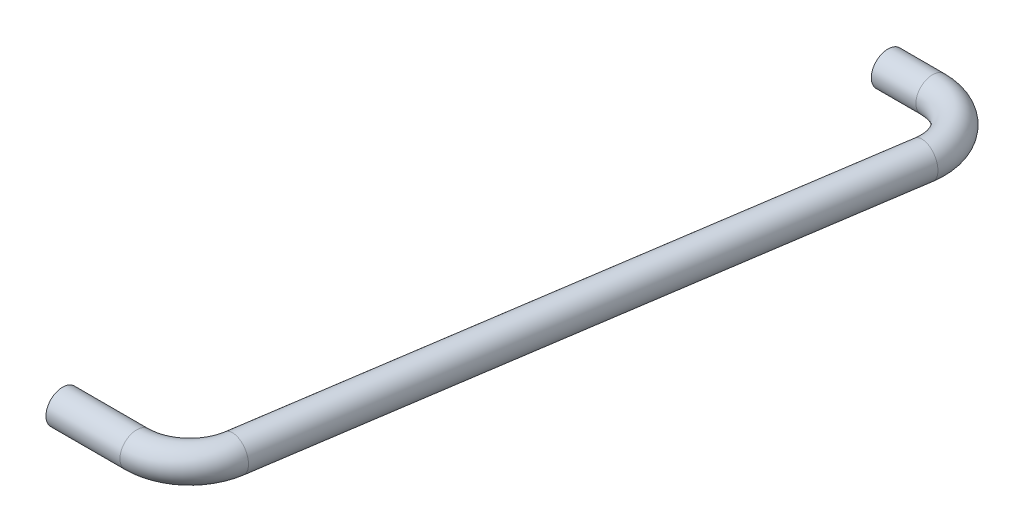
ISO-10303-21;
HEADER;
FILE_DESCRIPTION(('STEP AP214'),'2;1');
FILE_NAME('part.step','',(''),(''),'','','');
FILE_SCHEMA(('AUTOMOTIVE_DESIGN { 1 0 10303 214 1 1 1 1 }'));
ENDSEC;
DATA;
#1=APPLICATION_CONTEXT('core data for automotive mechanical design processes');
#2=APPLICATION_PROTOCOL_DEFINITION('international standard','automotive_design',2000,#1);
#3=PRODUCT_CONTEXT('',#1,'mechanical');
#4=PRODUCT('Part','Part','',(#3));
#5=PRODUCT_RELATED_PRODUCT_CATEGORY('part','',(#4));
#6=PRODUCT_DEFINITION_FORMATION('','',#4);
#7=PRODUCT_DEFINITION_CONTEXT('part definition',#1,'design');
#8=PRODUCT_DEFINITION('design','',#6,#7);
#9=PRODUCT_DEFINITION_SHAPE('','',#8);
#10=(LENGTH_UNIT() NAMED_UNIT(*) SI_UNIT(.MILLI.,.METRE.));
#11=(NAMED_UNIT(*) PLANE_ANGLE_UNIT() SI_UNIT($,.RADIAN.));
#12=(NAMED_UNIT(*) SI_UNIT($,.STERADIAN.) SOLID_ANGLE_UNIT());
#13=UNCERTAINTY_MEASURE_WITH_UNIT(LENGTH_MEASURE(1.E-05),#10,'distance_accuracy_value','');
#14=(GEOMETRIC_REPRESENTATION_CONTEXT(3) GLOBAL_UNCERTAINTY_ASSIGNED_CONTEXT((#13)) GLOBAL_UNIT_ASSIGNED_CONTEXT((#10,
#11,#12)) REPRESENTATION_CONTEXT('',''));
#15=CARTESIAN_POINT('',(0.,0.,0.));
#16=DIRECTION('',(0.,0.,1.));
#17=DIRECTION('',(1.,0.,0.));
#18=AXIS2_PLACEMENT_3D('',#15,#16,#17);
#19=CARTESIAN_POINT('',(-17.,0.,53.));
#20=DIRECTION('',(1.,0.,0.));
#21=DIRECTION('',(0.,0.,-1.));
#22=AXIS2_PLACEMENT_3D('',#19,#20,#21);
#23=PLANE('',#22);
#24=CARTESIAN_POINT('',(-17.,0.,53.));
#25=DIRECTION('',(1.,0.,0.));
#26=DIRECTION('',(0.,0.,-1.));
#27=AXIS2_PLACEMENT_3D('',#24,#25,#26);
#28=CIRCLE('',#27,1.25);
#29=CARTESIAN_POINT('',(-17.,0.,51.75));
#30=VERTEX_POINT('',#29);
#31=EDGE_CURVE('E46',#30,#30,#28,.T.);
#32=ORIENTED_EDGE('',*,*,#31,.F.);
#33=EDGE_LOOP('',(#32));
#34=FACE_BOUND('',#33,.T.);
#35=ADVANCED_FACE('F34',(#34),#23,.F.);
#36=CARTESIAN_POINT('',(-8.,0.,0.));
#37=DIRECTION('',(-1.,0.,0.));
#38=DIRECTION('',(0.,0.,1.));
#39=AXIS2_PLACEMENT_3D('',#36,#37,#38);
#40=PLANE('',#39);
#41=CARTESIAN_POINT('',(-8.,0.,0.));
#42=DIRECTION('',(-1.,0.,0.));
#43=DIRECTION('',(0.,0.,1.));
#44=AXIS2_PLACEMENT_3D('',#41,#42,#43);
#45=CIRCLE('',#44,1.25);
#46=CARTESIAN_POINT('',(-8.,0.,1.25));
#47=VERTEX_POINT('',#46);
#48=EDGE_CURVE('E11',#47,#47,#45,.T.);
#49=ORIENTED_EDGE('',*,*,#48,.T.);
#50=EDGE_LOOP('',(#49));
#51=FACE_BOUND('',#50,.T.);
#52=ADVANCED_FACE('F49',(#51),#40,.T.);
#53=CARTESIAN_POINT('',(-17.,0.,53.));
#54=DIRECTION('',(1.,0.,0.));
#55=DIRECTION('',(0.,0.,-1.));
#56=AXIS2_PLACEMENT_3D('',#53,#54,#55);
#57=CYLINDRICAL_SURFACE('',#56,1.25);
#58=CARTESIAN_POINT('',(-11.4415375949456,0.,53.));
#59=DIRECTION('',(1.,0.,0.));
#60=DIRECTION('',(0.,0.,-1.));
#61=AXIS2_PLACEMENT_3D('',#58,#59,#60);
#62=CIRCLE('',#61,1.25);
#63=CARTESIAN_POINT('',(-11.4415375949456,0.,54.25));
#64=VERTEX_POINT('',#63);
#65=EDGE_CURVE('E66',#64,#64,#62,.T.);
#66=ORIENTED_EDGE('',*,*,#65,.F.);
#67=EDGE_LOOP('',(#66));
#68=FACE_BOUND('',#67,.T.);
#69=ORIENTED_EDGE('',*,*,#31,.T.);
#70=EDGE_LOOP('',(#69));
#71=FACE_BOUND('',#70,.T.);
#72=ADVANCED_FACE('F70',(#68,#71),#57,.T.);
#73=CARTESIAN_POINT('',(-11.4415375949456,0.,49.));
#74=DIRECTION('',(0.,1.,0.));
#75=DIRECTION('',(0.,0.,1.));
#76=AXIS2_PLACEMENT_3D('',#73,#74,#75);
#77=TOROIDAL_SURFACE('',#76,4.,1.25);
#78=CARTESIAN_POINT('',(-7.48634124819928,0.,49.5970107693202));
#79=DIRECTION('',(0.149252692330052,0.,-0.988799086686588));
#80=DIRECTION('',(-0.988799086686588,0.,-0.149252692330052));
#81=AXIS2_PLACEMENT_3D('',#78,#79,#80);
#82=CIRCLE('',#81,1.25);
#83=CARTESIAN_POINT('',(-6.25034238984104,0.,49.7835766347328));
#84=VERTEX_POINT('',#83);
#85=EDGE_CURVE('E61',#84,#84,#82,.T.);
#86=CARTESIAN_POINT('',(-11.4415375949456,0.,49.));
#87=DIRECTION('',(0.,1.,0.));
#88=DIRECTION('',(0.,0.,1.));
#89=AXIS2_PLACEMENT_3D('',#86,#87,#88);
#90=CIRCLE('',#89,5.25);
#91=EDGE_CURVE('',#64,#84,#90,.T.);
#92=ORIENTED_EDGE('',*,*,#65,.T.);
#93=ORIENTED_EDGE('',*,*,#85,.F.);
#94=ORIENTED_EDGE('',*,*,#91,.T.);
#95=ORIENTED_EDGE('',*,*,#91,.F.);
#96=EDGE_LOOP('',(#92,#94,#93,#95));
#97=FACE_BOUND('',#96,.T.);
#98=ADVANCED_FACE('F72',(#97),#77,.T.);
#99=CARTESIAN_POINT('',(-7.48634124819928,0.,49.5970107693202));
#100=DIRECTION('',(0.149252692330051,0.,-0.988799086686588));
#101=DIRECTION('',(-0.988799086686588,0.,-0.149252692330051));
#102=AXIS2_PLACEMENT_3D('',#99,#100,#101);
#103=CYLINDRICAL_SURFACE('',#102,1.25);
#104=CARTESIAN_POINT('',(-0.693888418010599,0.,4.5970107693202));
#105=DIRECTION('',(0.149252692330051,0.,-0.988799086686588));
#106=DIRECTION('',(-0.988799086686588,0.,-0.149252692330051));
#107=AXIS2_PLACEMENT_3D('',#104,#105,#106);
#108=CIRCLE('',#107,1.25);
#109=CARTESIAN_POINT('',(0.542110440347639,0.,4.78357663473277));
#110=VERTEX_POINT('',#109);
#111=EDGE_CURVE('E59',#110,#110,#108,.T.);
#112=ORIENTED_EDGE('',*,*,#111,.F.);
#113=EDGE_LOOP('',(#112));
#114=FACE_BOUND('',#113,.T.);
#115=ORIENTED_EDGE('',*,*,#85,.T.);
#116=EDGE_LOOP('',(#115));
#117=FACE_BOUND('',#116,.T.);
#118=ADVANCED_FACE('F79',(#114,#117),#103,.T.);
#119=CARTESIAN_POINT('',(-4.64908476475695,0.,4.));
#120=DIRECTION('',(0.,1.,0.));
#121=DIRECTION('',(0.,0.,1.));
#122=AXIS2_PLACEMENT_3D('',#119,#120,#121);
#123=TOROIDAL_SURFACE('',#122,4.,1.25);
#124=CARTESIAN_POINT('',(-4.64908476475695,0.,0.));
#125=DIRECTION('',(-1.,0.,0.));
#126=DIRECTION('',(0.,0.,1.));
#127=AXIS2_PLACEMENT_3D('',#124,#125,#126);
#128=CIRCLE('',#127,1.25);
#129=CARTESIAN_POINT('',(-4.64908476475695,0.,-1.25));
#130=VERTEX_POINT('',#129);
#131=EDGE_CURVE('E41',#130,#130,#128,.T.);
#132=CARTESIAN_POINT('',(-4.64908476475695,0.,4.));
#133=DIRECTION('',(0.,1.,0.));
#134=DIRECTION('',(0.,0.,1.));
#135=AXIS2_PLACEMENT_3D('',#132,#133,#134);
#136=CIRCLE('',#135,5.25);
#137=EDGE_CURVE('',#110,#130,#136,.T.);
#138=ORIENTED_EDGE('',*,*,#111,.T.);
#139=ORIENTED_EDGE('',*,*,#131,.F.);
#140=ORIENTED_EDGE('',*,*,#137,.T.);
#141=ORIENTED_EDGE('',*,*,#137,.F.);
#142=EDGE_LOOP('',(#138,#140,#139,#141));
#143=FACE_BOUND('',#142,.T.);
#144=ADVANCED_FACE('F54',(#143),#123,.T.);
#145=CARTESIAN_POINT('',(-4.64908476475695,0.,0.));
#146=DIRECTION('',(-1.,0.,0.));
#147=DIRECTION('',(0.,0.,1.));
#148=AXIS2_PLACEMENT_3D('',#145,#146,#147);
#149=CYLINDRICAL_SURFACE('',#148,1.25);
#150=ORIENTED_EDGE('',*,*,#48,.F.);
#151=EDGE_LOOP('',(#150));
#152=FACE_BOUND('',#151,.T.);
#153=ORIENTED_EDGE('',*,*,#131,.T.);
#154=EDGE_LOOP('',(#153));
#155=FACE_BOUND('',#154,.T.);
#156=ADVANCED_FACE('F51',(#152,#155),#149,.T.);
#157=CLOSED_SHELL('',(#35,#52,#72,#98,#118,#144,#156));
#158=MANIFOLD_SOLID_BREP('B2',#157);
#159=ADVANCED_BREP_SHAPE_REPRESENTATION('',(#18,#158),#14);
#160=SHAPE_DEFINITION_REPRESENTATION(#9,#159);
ENDSEC;
END-ISO-10303-21;
